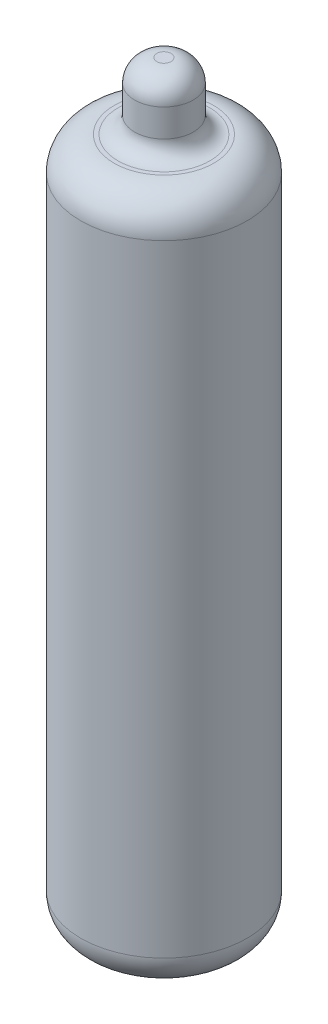
ISO-10303-21;
HEADER;
FILE_DESCRIPTION(('STEP AP214'),'2;1');
FILE_NAME('part.step','',(''),(''),'','','');
FILE_SCHEMA(('AUTOMOTIVE_DESIGN { 1 0 10303 214 1 1 1 1 }'));
ENDSEC;
DATA;
#1=APPLICATION_CONTEXT('core data for automotive mechanical design processes');
#2=APPLICATION_PROTOCOL_DEFINITION('international standard','automotive_design',2000,#1);
#3=PRODUCT_CONTEXT('',#1,'mechanical');
#4=PRODUCT('Part','Part','',(#3));
#5=PRODUCT_RELATED_PRODUCT_CATEGORY('part','',(#4));
#6=PRODUCT_DEFINITION_FORMATION('','',#4);
#7=PRODUCT_DEFINITION_CONTEXT('part definition',#1,'design');
#8=PRODUCT_DEFINITION('design','',#6,#7);
#9=PRODUCT_DEFINITION_SHAPE('','',#8);
#10=(LENGTH_UNIT() NAMED_UNIT(*) SI_UNIT(.MILLI.,.METRE.));
#11=(NAMED_UNIT(*) PLANE_ANGLE_UNIT() SI_UNIT($,.RADIAN.));
#12=(NAMED_UNIT(*) SI_UNIT($,.STERADIAN.) SOLID_ANGLE_UNIT());
#13=UNCERTAINTY_MEASURE_WITH_UNIT(LENGTH_MEASURE(1.E-05),#10,'distance_accuracy_value','');
#14=(GEOMETRIC_REPRESENTATION_CONTEXT(3) GLOBAL_UNCERTAINTY_ASSIGNED_CONTEXT((#13)) GLOBAL_UNIT_ASSIGNED_CONTEXT((#10,
#11,#12)) REPRESENTATION_CONTEXT('',''));
#15=CARTESIAN_POINT('',(0.,0.,0.));
#16=DIRECTION('',(0.,0.,1.));
#17=DIRECTION('',(1.,0.,0.));
#18=AXIS2_PLACEMENT_3D('',#15,#16,#17);
#19=CARTESIAN_POINT('',(0.,0.,0.));
#20=DIRECTION('',(0.,1.,0.));
#21=DIRECTION('',(0.,0.,1.));
#22=AXIS2_PLACEMENT_3D('',#19,#20,#21);
#23=PLANE('',#22);
#24=CARTESIAN_POINT('',(0.,0.,0.));
#25=DIRECTION('',(0.,1.,0.));
#26=DIRECTION('',(0.,0.,1.));
#27=AXIS2_PLACEMENT_3D('',#24,#25,#26);
#28=CIRCLE('',#27,4.49999999999998);
#29=CARTESIAN_POINT('',(0.,0.,4.49999999999998));
#30=VERTEX_POINT('',#29);
#31=EDGE_CURVE('E10',#30,#30,#28,.T.);
#32=ORIENTED_EDGE('',*,*,#31,.F.);
#33=EDGE_LOOP('',(#32));
#34=FACE_BOUND('',#33,.T.);
#35=ADVANCED_FACE('F31',(#34),#23,.F.);
#36=CARTESIAN_POINT('',(0.,3.,0.));
#37=DIRECTION('',(0.,1.,0.));
#38=DIRECTION('',(0.,0.,1.));
#39=AXIS2_PLACEMENT_3D('',#36,#37,#38);
#40=TOROIDAL_SURFACE('',#39,4.5,3.);
#41=CARTESIAN_POINT('',(0.,3.,0.));
#42=DIRECTION('',(0.,1.,0.));
#43=DIRECTION('',(0.,0.,1.));
#44=AXIS2_PLACEMENT_3D('',#41,#42,#43);
#45=CIRCLE('',#44,7.5);
#46=CARTESIAN_POINT('',(0.,3.,7.5));
#47=VERTEX_POINT('',#46);
#48=EDGE_CURVE('E37',#47,#47,#45,.T.);
#49=ORIENTED_EDGE('',*,*,#48,.F.);
#50=EDGE_LOOP('',(#49));
#51=FACE_BOUND('',#50,.T.);
#52=ORIENTED_EDGE('',*,*,#31,.T.);
#53=EDGE_LOOP('',(#52));
#54=FACE_BOUND('',#53,.T.);
#55=ADVANCED_FACE('F97',(#51,#54),#40,.T.);
#56=CARTESIAN_POINT('',(0.,68.,0.));
#57=DIRECTION('',(0.,1.,0.));
#58=DIRECTION('',(0.,0.,1.));
#59=AXIS2_PLACEMENT_3D('',#56,#57,#58);
#60=CYLINDRICAL_SURFACE('',#59,7.5);
#61=CARTESIAN_POINT('',(0.,59.,0.));
#62=DIRECTION('',(0.,1.,0.));
#63=DIRECTION('',(0.,0.,1.));
#64=AXIS2_PLACEMENT_3D('',#61,#62,#63);
#65=CIRCLE('',#64,7.5);
#66=CARTESIAN_POINT('',(0.,59.,7.5));
#67=VERTEX_POINT('',#66);
#68=EDGE_CURVE('E41',#67,#67,#65,.T.);
#69=ORIENTED_EDGE('',*,*,#68,.F.);
#70=EDGE_LOOP('',(#69));
#71=FACE_BOUND('',#70,.T.);
#72=ORIENTED_EDGE('',*,*,#48,.T.);
#73=EDGE_LOOP('',(#72));
#74=FACE_BOUND('',#73,.T.);
#75=ADVANCED_FACE('F92',(#71,#74),#60,.T.);
#76=CARTESIAN_POINT('',(0.,59.,0.));
#77=DIRECTION('',(0.,1.,0.));
#78=DIRECTION('',(0.,0.,1.));
#79=AXIS2_PLACEMENT_3D('',#76,#77,#78);
#80=TOROIDAL_SURFACE('',#79,4.5,3.);
#81=CARTESIAN_POINT('',(0.,62.,0.));
#82=DIRECTION('',(0.,1.,0.));
#83=DIRECTION('',(0.,0.,1.));
#84=AXIS2_PLACEMENT_3D('',#81,#82,#83);
#85=CIRCLE('',#84,4.49999999999998);
#86=CARTESIAN_POINT('',(0.,62.,4.49999999999998));
#87=VERTEX_POINT('',#86);
#88=EDGE_CURVE('E45',#87,#87,#85,.T.);
#89=ORIENTED_EDGE('',*,*,#88,.F.);
#90=EDGE_LOOP('',(#89));
#91=FACE_BOUND('',#90,.T.);
#92=ORIENTED_EDGE('',*,*,#68,.T.);
#93=EDGE_LOOP('',(#92));
#94=FACE_BOUND('',#93,.T.);
#95=ADVANCED_FACE('F86',(#91,#94),#80,.T.);
#96=CARTESIAN_POINT('',(4.49999999999998,62.,0.));
#97=DIRECTION('',(0.,-1.,0.));
#98=DIRECTION('',(0.,0.,-1.));
#99=AXIS2_PLACEMENT_3D('',#96,#97,#98);
#100=PLANE('',#99);
#101=CARTESIAN_POINT('',(0.,62.,0.));
#102=DIRECTION('',(0.,1.,0.));
#103=DIRECTION('',(0.,0.,1.));
#104=AXIS2_PLACEMENT_3D('',#101,#102,#103);
#105=CIRCLE('',#104,4.14067501595769);
#106=CARTESIAN_POINT('',(0.,62.,4.14067501595769));
#107=VERTEX_POINT('',#106);
#108=EDGE_CURVE('E50',#107,#107,#105,.T.);
#109=ORIENTED_EDGE('',*,*,#108,.F.);
#110=EDGE_LOOP('',(#109));
#111=FACE_BOUND('',#110,.T.);
#112=ORIENTED_EDGE('',*,*,#88,.T.);
#113=EDGE_LOOP('',(#112));
#114=FACE_BOUND('',#113,.T.);
#115=ADVANCED_FACE('F80',(#111,#114),#100,.F.);
#116=CARTESIAN_POINT('',(0.,63.5,0.));
#117=DIRECTION('',(0.,1.,0.));
#118=DIRECTION('',(0.,0.,1.));
#119=AXIS2_PLACEMENT_3D('',#116,#117,#118);
#120=TOROIDAL_SURFACE('',#119,4.14067501595768,1.5);
#121=CARTESIAN_POINT('',(0.,63.5,0.));
#122=DIRECTION('',(0.,1.,0.));
#123=DIRECTION('',(0.,0.,1.));
#124=AXIS2_PLACEMENT_3D('',#121,#122,#123);
#125=CIRCLE('',#124,2.64067501595768);
#126=CARTESIAN_POINT('',(0.,63.5,2.64067501595768));
#127=VERTEX_POINT('',#126);
#128=EDGE_CURVE('E53',#127,#127,#125,.T.);
#129=ORIENTED_EDGE('',*,*,#128,.F.);
#130=EDGE_LOOP('',(#129));
#131=FACE_BOUND('',#130,.T.);
#132=ORIENTED_EDGE('',*,*,#108,.T.);
#133=EDGE_LOOP('',(#132));
#134=FACE_BOUND('',#133,.T.);
#135=ADVANCED_FACE('F74',(#131,#134),#120,.F.);
#136=CARTESIAN_POINT('',(0.,68.,0.));
#137=DIRECTION('',(0.,1.,0.));
#138=DIRECTION('',(0.,0.,1.));
#139=AXIS2_PLACEMENT_3D('',#136,#137,#138);
#140=CYLINDRICAL_SURFACE('',#139,2.64067501595768);
#141=CARTESIAN_POINT('',(0.,66.,0.));
#142=DIRECTION('',(0.,1.,0.));
#143=DIRECTION('',(0.,0.,1.));
#144=AXIS2_PLACEMENT_3D('',#141,#142,#143);
#145=CIRCLE('',#144,2.64067501595768);
#146=CARTESIAN_POINT('',(0.,66.,2.64067501595768));
#147=VERTEX_POINT('',#146);
#148=EDGE_CURVE('E56',#147,#147,#145,.T.);
#149=ORIENTED_EDGE('',*,*,#148,.F.);
#150=EDGE_LOOP('',(#149));
#151=FACE_BOUND('',#150,.T.);
#152=ORIENTED_EDGE('',*,*,#128,.T.);
#153=EDGE_LOOP('',(#152));
#154=FACE_BOUND('',#153,.T.);
#155=ADVANCED_FACE('F68',(#151,#154),#140,.T.);
#156=CARTESIAN_POINT('',(0.,66.,0.));
#157=DIRECTION('',(0.,1.,0.));
#158=DIRECTION('',(0.,0.,1.));
#159=AXIS2_PLACEMENT_3D('',#156,#157,#158);
#160=DEGENERATE_TOROIDAL_SURFACE('',#159,0.640675015957682,2.,.T.);
#161=CARTESIAN_POINT('',(0.,68.,0.));
#162=DIRECTION('',(0.,1.,0.));
#163=DIRECTION('',(0.,0.,1.));
#164=AXIS2_PLACEMENT_3D('',#161,#162,#163);
#165=CIRCLE('',#164,0.640675015957667);
#166=CARTESIAN_POINT('',(0.,68.,0.640675015957667));
#167=VERTEX_POINT('',#166);
#168=EDGE_CURVE('E59',#167,#167,#165,.T.);
#169=ORIENTED_EDGE('',*,*,#168,.F.);
#170=EDGE_LOOP('',(#169));
#171=FACE_BOUND('',#170,.T.);
#172=ORIENTED_EDGE('',*,*,#148,.T.);
#173=EDGE_LOOP('',(#172));
#174=FACE_BOUND('',#173,.T.);
#175=ADVANCED_FACE('F65',(#171,#174),#160,.T.);
#176=CARTESIAN_POINT('',(0.640675015957667,68.,0.));
#177=DIRECTION('',(0.,-1.,0.));
#178=DIRECTION('',(0.,0.,-1.));
#179=AXIS2_PLACEMENT_3D('',#176,#177,#178);
#180=PLANE('',#179);
#181=ORIENTED_EDGE('',*,*,#168,.T.);
#182=EDGE_LOOP('',(#181));
#183=FACE_BOUND('',#182,.T.);
#184=ADVANCED_FACE('F63',(#183),#180,.F.);
#185=CLOSED_SHELL('',(#35,#55,#75,#95,#115,#135,#155,#175,#184));
#186=MANIFOLD_SOLID_BREP('B2',#185);
#187=ADVANCED_BREP_SHAPE_REPRESENTATION('',(#18,#186),#14);
#188=SHAPE_DEFINITION_REPRESENTATION(#9,#187);
ENDSEC;
END-ISO-10303-21;
